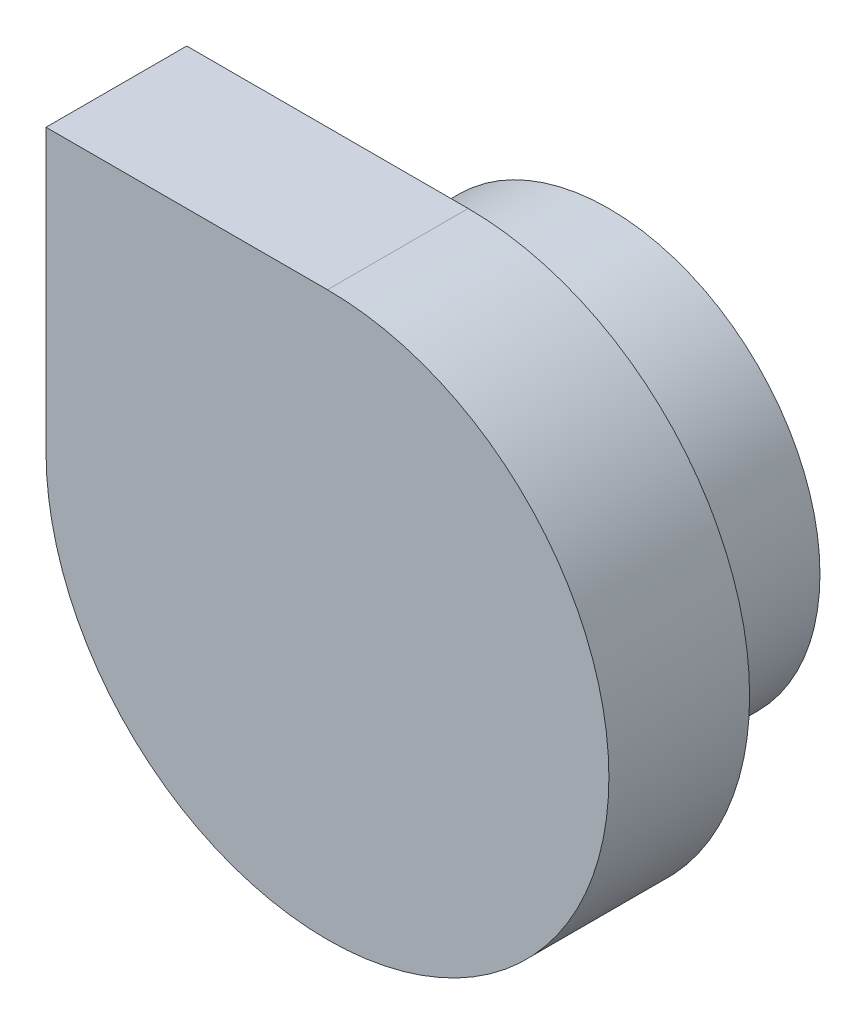
ISO-10303-21;
HEADER;
FILE_DESCRIPTION(('STEP AP214'),'2;1');
FILE_NAME('part.step','',(''),(''),'','','');
FILE_SCHEMA(('AUTOMOTIVE_DESIGN { 1 0 10303 214 1 1 1 1 }'));
ENDSEC;
DATA;
#1=APPLICATION_CONTEXT('core data for automotive mechanical design processes');
#2=APPLICATION_PROTOCOL_DEFINITION('international standard','automotive_design',2000,#1);
#3=PRODUCT_CONTEXT('',#1,'mechanical');
#4=PRODUCT('Part','Part','',(#3));
#5=PRODUCT_RELATED_PRODUCT_CATEGORY('part','',(#4));
#6=PRODUCT_DEFINITION_FORMATION('','',#4);
#7=PRODUCT_DEFINITION_CONTEXT('part definition',#1,'design');
#8=PRODUCT_DEFINITION('design','',#6,#7);
#9=PRODUCT_DEFINITION_SHAPE('','',#8);
#10=(LENGTH_UNIT() NAMED_UNIT(*) SI_UNIT(.MILLI.,.METRE.));
#11=(NAMED_UNIT(*) PLANE_ANGLE_UNIT() SI_UNIT($,.RADIAN.));
#12=(NAMED_UNIT(*) SI_UNIT($,.STERADIAN.) SOLID_ANGLE_UNIT());
#13=UNCERTAINTY_MEASURE_WITH_UNIT(LENGTH_MEASURE(1.E-05),#10,'distance_accuracy_value','');
#14=(GEOMETRIC_REPRESENTATION_CONTEXT(3) GLOBAL_UNCERTAINTY_ASSIGNED_CONTEXT((#13)) GLOBAL_UNIT_ASSIGNED_CONTEXT((#10,
#11,#12)) REPRESENTATION_CONTEXT('',''));
#15=CARTESIAN_POINT('',(0.,0.,0.));
#16=DIRECTION('',(0.,0.,1.));
#17=DIRECTION('',(1.,0.,0.));
#18=AXIS2_PLACEMENT_3D('',#15,#16,#17);
#19=CARTESIAN_POINT('',(0.,0.,-50.));
#20=DIRECTION('',(0.,0.,1.));
#21=DIRECTION('',(1.,0.,0.));
#22=AXIS2_PLACEMENT_3D('',#19,#20,#21);
#23=CYLINDRICAL_SURFACE('',#22,100.);
#24=CARTESIAN_POINT('',(0.,0.,0.));
#25=DIRECTION('',(0.,0.,1.));
#26=DIRECTION('',(1.,0.,0.));
#27=AXIS2_PLACEMENT_3D('',#24,#25,#26);
#28=CIRCLE('',#27,100.);
#29=CARTESIAN_POINT('',(-100.,0.,0.));
#30=VERTEX_POINT('',#29);
#31=CARTESIAN_POINT('',(0.,100.,0.));
#32=VERTEX_POINT('',#31);
#33=EDGE_CURVE('E88',#30,#32,#28,.T.);
#34=ORIENTED_EDGE('',*,*,#33,.F.);
#35=DIRECTION('',(0.,0.,1.));
#36=VECTOR('',#35,1.);
#37=CARTESIAN_POINT('',(-100.,0.,-50.));
#38=LINE('',#37,#36);
#39=CARTESIAN_POINT('',(-100.,0.,-50.));
#40=VERTEX_POINT('',#39);
#41=EDGE_CURVE('E40',#40,#30,#38,.T.);
#42=ORIENTED_EDGE('',*,*,#41,.F.);
#43=CARTESIAN_POINT('',(0.,0.,-50.));
#44=DIRECTION('',(0.,0.,1.));
#45=DIRECTION('',(1.,0.,0.));
#46=AXIS2_PLACEMENT_3D('',#43,#44,#45);
#47=CIRCLE('',#46,100.);
#48=CARTESIAN_POINT('',(0.,100.,-50.));
#49=VERTEX_POINT('',#48);
#50=EDGE_CURVE('E77',#40,#49,#47,.T.);
#51=ORIENTED_EDGE('',*,*,#50,.T.);
#52=DIRECTION('',(0.,0.,1.));
#53=VECTOR('',#52,1.);
#54=CARTESIAN_POINT('',(0.,100.,-50.));
#55=LINE('',#54,#53);
#56=EDGE_CURVE('E67',#49,#32,#55,.T.);
#57=ORIENTED_EDGE('',*,*,#56,.T.);
#58=EDGE_LOOP('',(#34,#42,#51,#57));
#59=FACE_BOUND('',#58,.T.);
#60=ADVANCED_FACE('F32',(#59),#23,.T.);
#61=CARTESIAN_POINT('',(-100.,0.,-50.));
#62=DIRECTION('',(-1.,0.,0.));
#63=DIRECTION('',(0.,-1.,0.));
#64=AXIS2_PLACEMENT_3D('',#61,#62,#63);
#65=PLANE('',#64);
#66=DIRECTION('',(0.,-1.,0.));
#67=VECTOR('',#66,1.);
#68=CARTESIAN_POINT('',(-100.,0.,0.));
#69=LINE('',#68,#67);
#70=CARTESIAN_POINT('',(-100.,100.,0.));
#71=VERTEX_POINT('',#70);
#72=EDGE_CURVE('E79',#71,#30,#69,.T.);
#73=ORIENTED_EDGE('',*,*,#72,.F.);
#74=DIRECTION('',(0.,0.,1.));
#75=VECTOR('',#74,1.);
#76=CARTESIAN_POINT('',(-100.,100.,-50.));
#77=LINE('',#76,#75);
#78=CARTESIAN_POINT('',(-100.,100.,-50.));
#79=VERTEX_POINT('',#78);
#80=EDGE_CURVE('E61',#79,#71,#77,.T.);
#81=ORIENTED_EDGE('',*,*,#80,.F.);
#82=DIRECTION('',(0.,-1.,0.));
#83=VECTOR('',#82,1.);
#84=CARTESIAN_POINT('',(-100.,0.,-50.));
#85=LINE('',#84,#83);
#86=EDGE_CURVE('E74',#79,#40,#85,.T.);
#87=ORIENTED_EDGE('',*,*,#86,.T.);
#88=ORIENTED_EDGE('',*,*,#41,.T.);
#89=EDGE_LOOP('',(#73,#81,#87,#88));
#90=FACE_BOUND('',#89,.T.);
#91=ADVANCED_FACE('F94',(#90),#65,.T.);
#92=CARTESIAN_POINT('',(-100.,100.,-50.));
#93=DIRECTION('',(0.,1.,0.));
#94=DIRECTION('',(-1.,0.,0.));
#95=AXIS2_PLACEMENT_3D('',#92,#93,#94);
#96=PLANE('',#95);
#97=DIRECTION('',(-1.,0.,0.));
#98=VECTOR('',#97,1.);
#99=CARTESIAN_POINT('',(-100.,100.,0.));
#100=LINE('',#99,#98);
#101=EDGE_CURVE('E72',#32,#71,#100,.T.);
#102=ORIENTED_EDGE('',*,*,#101,.F.);
#103=ORIENTED_EDGE('',*,*,#56,.F.);
#104=DIRECTION('',(-1.,0.,0.));
#105=VECTOR('',#104,1.);
#106=CARTESIAN_POINT('',(-100.,100.,-50.));
#107=LINE('',#106,#105);
#108=EDGE_CURVE('E70',#49,#79,#107,.T.);
#109=ORIENTED_EDGE('',*,*,#108,.T.);
#110=ORIENTED_EDGE('',*,*,#80,.T.);
#111=EDGE_LOOP('',(#102,#103,#109,#110));
#112=FACE_BOUND('',#111,.T.);
#113=ADVANCED_FACE('F69',(#112),#96,.T.);
#114=CARTESIAN_POINT('',(0.,0.,-50.));
#115=DIRECTION('',(0.,0.,1.));
#116=DIRECTION('',(1.,0.,0.));
#117=AXIS2_PLACEMENT_3D('',#114,#115,#116);
#118=PLANE('',#117);
#119=CARTESIAN_POINT('',(0.,0.,-50.));
#120=DIRECTION('',(0.,0.,1.));
#121=DIRECTION('',(1.,0.,0.));
#122=AXIS2_PLACEMENT_3D('',#119,#120,#121);
#123=CIRCLE('',#122,75.);
#124=CARTESIAN_POINT('',(75.,0.,-50.));
#125=VERTEX_POINT('',#124);
#126=EDGE_CURVE('E11',#125,#125,#123,.F.);
#127=ORIENTED_EDGE('',*,*,#126,.F.);
#128=EDGE_LOOP('',(#127));
#129=FACE_BOUND('',#128,.T.);
#130=ORIENTED_EDGE('',*,*,#50,.F.);
#131=ORIENTED_EDGE('',*,*,#86,.F.);
#132=ORIENTED_EDGE('',*,*,#108,.F.);
#133=EDGE_LOOP('',(#130,#131,#132));
#134=FACE_BOUND('',#133,.T.);
#135=ADVANCED_FACE('F76',(#129,#134),#118,.F.);
#136=CARTESIAN_POINT('',(0.,0.,0.));
#137=DIRECTION('',(0.,0.,1.));
#138=DIRECTION('',(1.,0.,0.));
#139=AXIS2_PLACEMENT_3D('',#136,#137,#138);
#140=PLANE('',#139);
#141=ORIENTED_EDGE('',*,*,#33,.T.);
#142=ORIENTED_EDGE('',*,*,#101,.T.);
#143=ORIENTED_EDGE('',*,*,#72,.T.);
#144=EDGE_LOOP('',(#141,#142,#143));
#145=FACE_BOUND('',#144,.T.);
#146=ADVANCED_FACE('F93',(#145),#140,.T.);
#147=CARTESIAN_POINT('',(0.,0.,-100.));
#148=DIRECTION('',(0.,0.,-1.));
#149=DIRECTION('',(-1.,0.,0.));
#150=AXIS2_PLACEMENT_3D('',#147,#148,#149);
#151=PLANE('',#150);
#152=CARTESIAN_POINT('',(0.,0.,-100.));
#153=DIRECTION('',(0.,0.,-1.));
#154=DIRECTION('',(-1.,0.,0.));
#155=AXIS2_PLACEMENT_3D('',#152,#153,#154);
#156=CIRCLE('',#155,75.);
#157=CARTESIAN_POINT('',(-75.,0.,-100.));
#158=VERTEX_POINT('',#157);
#159=EDGE_CURVE('E84',#158,#158,#156,.T.);
#160=ORIENTED_EDGE('',*,*,#159,.T.);
#161=EDGE_LOOP('',(#160));
#162=FACE_BOUND('',#161,.T.);
#163=CARTESIAN_POINT('',(0.,0.,-100.));
#164=DIRECTION('',(0.,0.,-1.));
#165=DIRECTION('',(-1.,0.,0.));
#166=AXIS2_PLACEMENT_3D('',#163,#164,#165);
#167=CIRCLE('',#166,50.);
#168=CARTESIAN_POINT('',(-50.,0.,-100.));
#169=VERTEX_POINT('',#168);
#170=EDGE_CURVE('E126',#169,#169,#167,.T.);
#171=ORIENTED_EDGE('',*,*,#170,.F.);
#172=EDGE_LOOP('',(#171));
#173=FACE_BOUND('',#172,.T.);
#174=ADVANCED_FACE('F104',(#162,#173),#151,.T.);
#175=CARTESIAN_POINT('',(0.,0.,-100.));
#176=DIRECTION('',(0.,0.,1.));
#177=DIRECTION('',(1.,0.,0.));
#178=AXIS2_PLACEMENT_3D('',#175,#176,#177);
#179=CYLINDRICAL_SURFACE('',#178,75.);
#180=ORIENTED_EDGE('',*,*,#159,.F.);
#181=EDGE_LOOP('',(#180));
#182=FACE_BOUND('',#181,.T.);
#183=ORIENTED_EDGE('',*,*,#126,.T.);
#184=EDGE_LOOP('',(#183));
#185=FACE_BOUND('',#184,.T.);
#186=ADVANCED_FACE('F109',(#182,#185),#179,.T.);
#187=CARTESIAN_POINT('',(0.,0.,-100.));
#188=DIRECTION('',(0.,0.,1.));
#189=DIRECTION('',(1.,0.,0.));
#190=AXIS2_PLACEMENT_3D('',#187,#188,#189);
#191=CYLINDRICAL_SURFACE('',#190,50.);
#192=ORIENTED_EDGE('',*,*,#170,.T.);
#193=EDGE_LOOP('',(#192));
#194=FACE_BOUND('',#193,.T.);
#195=CARTESIAN_POINT('',(0.,0.,-50.));
#196=DIRECTION('',(0.,0.,-1.));
#197=DIRECTION('',(-1.,0.,0.));
#198=AXIS2_PLACEMENT_3D('',#195,#196,#197);
#199=CIRCLE('',#198,50.);
#200=CARTESIAN_POINT('',(-50.,0.,-50.));
#201=VERTEX_POINT('',#200);
#202=EDGE_CURVE('E129',#201,#201,#199,.T.);
#203=ORIENTED_EDGE('',*,*,#202,.F.);
#204=EDGE_LOOP('',(#203));
#205=FACE_BOUND('',#204,.T.);
#206=ADVANCED_FACE('F112',(#194,#205),#191,.F.);
#207=ORIENTED_EDGE('',*,*,#202,.T.);
#208=EDGE_LOOP('',(#207));
#209=FACE_BOUND('',#208,.T.);
#210=ADVANCED_FACE('F108',(#209),#118,.F.);
#211=CLOSED_SHELL('',(#60,#91,#113,#135,#146,#174,#186,#206,#210));
#212=MANIFOLD_SOLID_BREP('B2',#211);
#213=ADVANCED_BREP_SHAPE_REPRESENTATION('',(#18,#212),#14);
#214=SHAPE_DEFINITION_REPRESENTATION(#9,#213);
ENDSEC;
END-ISO-10303-21;
